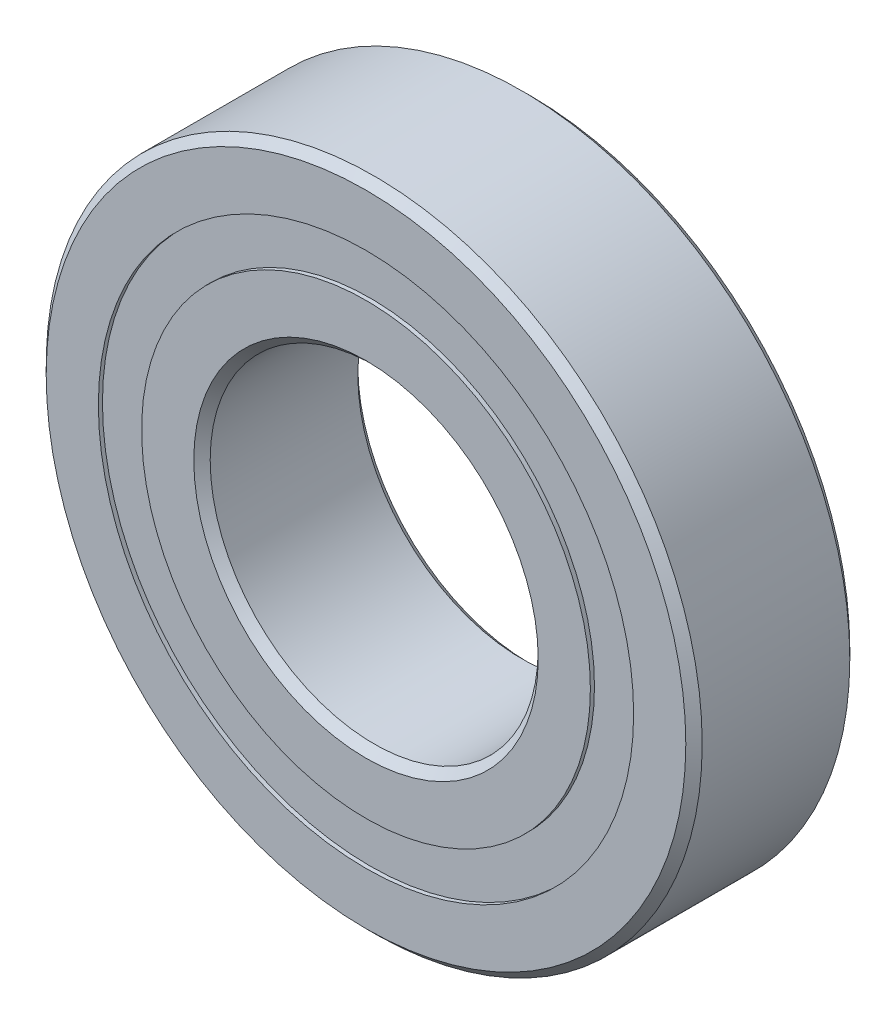
ISO-10303-21;
HEADER;
FILE_DESCRIPTION(('STEP AP214'),'2;1');
FILE_NAME('part.step','',(''),(''),'','','');
FILE_SCHEMA(('AUTOMOTIVE_DESIGN { 1 0 10303 214 1 1 1 1 }'));
ENDSEC;
DATA;
#1=APPLICATION_CONTEXT('core data for automotive mechanical design processes');
#2=APPLICATION_PROTOCOL_DEFINITION('international standard','automotive_design',2000,#1);
#3=PRODUCT_CONTEXT('',#1,'mechanical');
#4=PRODUCT('Part','Part','',(#3));
#5=PRODUCT_RELATED_PRODUCT_CATEGORY('part','',(#4));
#6=PRODUCT_DEFINITION_FORMATION('','',#4);
#7=PRODUCT_DEFINITION_CONTEXT('part definition',#1,'design');
#8=PRODUCT_DEFINITION('design','',#6,#7);
#9=PRODUCT_DEFINITION_SHAPE('','',#8);
#10=(LENGTH_UNIT() NAMED_UNIT(*) SI_UNIT(.MILLI.,.METRE.));
#11=(NAMED_UNIT(*) PLANE_ANGLE_UNIT() SI_UNIT($,.RADIAN.));
#12=(NAMED_UNIT(*) SI_UNIT($,.STERADIAN.) SOLID_ANGLE_UNIT());
#13=UNCERTAINTY_MEASURE_WITH_UNIT(LENGTH_MEASURE(1.E-05),#10,'distance_accuracy_value','');
#14=(GEOMETRIC_REPRESENTATION_CONTEXT(3) GLOBAL_UNCERTAINTY_ASSIGNED_CONTEXT((#13)) GLOBAL_UNIT_ASSIGNED_CONTEXT((#10,
#11,#12)) REPRESENTATION_CONTEXT('',''));
#15=CARTESIAN_POINT('',(0.,0.,0.));
#16=DIRECTION('',(0.,0.,1.));
#17=DIRECTION('',(1.,0.,0.));
#18=AXIS2_PLACEMENT_3D('',#15,#16,#17);
#19=CARTESIAN_POINT('',(0.,20.7247252747253,-6.0325));
#20=DIRECTION('',(0.,0.,1.));
#21=DIRECTION('',(1.,0.,0.));
#22=AXIS2_PLACEMENT_3D('',#19,#20,#21);
#23=PLANE('',#22);
#24=CARTESIAN_POINT('',(0.,0.,-6.0325));
#25=DIRECTION('',(0.,0.,1.));
#26=DIRECTION('',(1.,0.,0.));
#27=AXIS2_PLACEMENT_3D('',#24,#25,#26);
#28=CIRCLE('',#27,20.7247252747253);
#29=CARTESIAN_POINT('',(20.7247252747253,0.,-6.0325));
#30=VERTEX_POINT('',#29);
#31=EDGE_CURVE('E58',#30,#30,#28,.T.);
#32=ORIENTED_EDGE('',*,*,#31,.F.);
#33=EDGE_LOOP('',(#32));
#34=FACE_BOUND('',#33,.T.);
#35=CARTESIAN_POINT('',(0.,0.,-6.0325));
#36=DIRECTION('',(0.,0.,1.));
#37=DIRECTION('',(1.,0.,0.));
#38=AXIS2_PLACEMENT_3D('',#35,#36,#37);
#39=CIRCLE('',#38,17.3752747252747);
#40=CARTESIAN_POINT('',(17.3752747252747,0.,-6.0325));
#41=VERTEX_POINT('',#40);
#42=EDGE_CURVE('E11',#41,#41,#39,.T.);
#43=ORIENTED_EDGE('',*,*,#42,.T.);
#44=EDGE_LOOP('',(#43));
#45=FACE_BOUND('',#44,.T.);
#46=ADVANCED_FACE('F44',(#34,#45),#23,.F.);
#47=CARTESIAN_POINT('',(0.,0.,6.35));
#48=DIRECTION('',(0.,0.,1.));
#49=DIRECTION('',(1.,0.,0.));
#50=AXIS2_PLACEMENT_3D('',#47,#48,#49);
#51=CYLINDRICAL_SURFACE('',#50,17.3752747252747);
#52=ORIENTED_EDGE('',*,*,#42,.F.);
#53=EDGE_LOOP('',(#52));
#54=FACE_BOUND('',#53,.T.);
#55=CARTESIAN_POINT('',(0.,0.,-3.28171342706955));
#56=DIRECTION('',(0.,0.,1.));
#57=DIRECTION('',(1.,0.,0.));
#58=AXIS2_PLACEMENT_3D('',#55,#56,#57);
#59=CIRCLE('',#58,17.3752747252747);
#60=CARTESIAN_POINT('',(17.3752747252747,0.,-3.28171342706955));
#61=VERTEX_POINT('',#60);
#62=EDGE_CURVE('E50',#61,#61,#59,.T.);
#63=ORIENTED_EDGE('',*,*,#62,.T.);
#64=EDGE_LOOP('',(#63));
#65=FACE_BOUND('',#64,.T.);
#66=ADVANCED_FACE('F67',(#54,#65),#51,.F.);
#67=CARTESIAN_POINT('',(0.,20.7247252747253,-3.28171342706955));
#68=DIRECTION('',(0.,0.,-1.));
#69=DIRECTION('',(-1.,0.,0.));
#70=AXIS2_PLACEMENT_3D('',#67,#68,#69);
#71=PLANE('',#70);
#72=ORIENTED_EDGE('',*,*,#62,.F.);
#73=EDGE_LOOP('',(#72));
#74=FACE_BOUND('',#73,.T.);
#75=CARTESIAN_POINT('',(0.,0.,-3.28171342706955));
#76=DIRECTION('',(0.,0.,1.));
#77=DIRECTION('',(1.,0.,0.));
#78=AXIS2_PLACEMENT_3D('',#75,#76,#77);
#79=CIRCLE('',#78,20.7247252747253);
#80=CARTESIAN_POINT('',(20.7247252747253,0.,-3.28171342706955));
#81=VERTEX_POINT('',#80);
#82=EDGE_CURVE('E54',#81,#81,#79,.T.);
#83=ORIENTED_EDGE('',*,*,#82,.T.);
#84=EDGE_LOOP('',(#83));
#85=FACE_BOUND('',#84,.T.);
#86=ADVANCED_FACE('F71',(#74,#85),#71,.F.);
#87=CARTESIAN_POINT('',(0.,0.,6.35));
#88=DIRECTION('',(0.,0.,1.));
#89=DIRECTION('',(1.,0.,0.));
#90=AXIS2_PLACEMENT_3D('',#87,#88,#89);
#91=CYLINDRICAL_SURFACE('',#90,20.7247252747253);
#92=ORIENTED_EDGE('',*,*,#82,.F.);
#93=EDGE_LOOP('',(#92));
#94=FACE_BOUND('',#93,.T.);
#95=ORIENTED_EDGE('',*,*,#31,.T.);
#96=EDGE_LOOP('',(#95));
#97=FACE_BOUND('',#96,.T.);
#98=ADVANCED_FACE('F64',(#94,#97),#91,.T.);
#99=CLOSED_SHELL('',(#46,#66,#86,#98));
#100=MANIFOLD_SOLID_BREP('B2',#99);
#101=CARTESIAN_POINT('',(0.,20.7247252747253,6.03250000000001));
#102=DIRECTION('',(0.,0.,-1.));
#103=DIRECTION('',(-1.,0.,0.));
#104=AXIS2_PLACEMENT_3D('',#101,#102,#103);
#105=PLANE('',#104);
#106=CARTESIAN_POINT('',(0.,0.,6.03250000000001));
#107=DIRECTION('',(0.,0.,1.));
#108=DIRECTION('',(1.,0.,0.));
#109=AXIS2_PLACEMENT_3D('',#106,#107,#108);
#110=CIRCLE('',#109,17.3752747252747);
#111=CARTESIAN_POINT('',(17.3752747252747,0.,6.03250000000001));
#112=VERTEX_POINT('',#111);
#113=EDGE_CURVE('E43',#112,#112,#110,.T.);
#114=ORIENTED_EDGE('',*,*,#113,.F.);
#115=EDGE_LOOP('',(#114));
#116=FACE_BOUND('',#115,.T.);
#117=CARTESIAN_POINT('',(0.,0.,6.03250000000001));
#118=DIRECTION('',(0.,0.,1.));
#119=DIRECTION('',(1.,0.,0.));
#120=AXIS2_PLACEMENT_3D('',#117,#118,#119);
#121=CIRCLE('',#120,20.7247252747253);
#122=CARTESIAN_POINT('',(20.7247252747253,0.,6.03250000000001));
#123=VERTEX_POINT('',#122);
#124=EDGE_CURVE('E126',#123,#123,#121,.T.);
#125=ORIENTED_EDGE('',*,*,#124,.T.);
#126=EDGE_LOOP('',(#125));
#127=FACE_BOUND('',#126,.T.);
#128=ADVANCED_FACE('F112',(#116,#127),#105,.F.);
#129=CARTESIAN_POINT('',(0.,0.,6.35));
#130=DIRECTION('',(0.,0.,1.));
#131=DIRECTION('',(1.,0.,0.));
#132=AXIS2_PLACEMENT_3D('',#129,#130,#131);
#133=CYLINDRICAL_SURFACE('',#132,17.3752747252747);
#134=CARTESIAN_POINT('',(0.,0.,3.28171342706955));
#135=DIRECTION('',(0.,0.,1.));
#136=DIRECTION('',(1.,0.,0.));
#137=AXIS2_PLACEMENT_3D('',#134,#135,#136);
#138=CIRCLE('',#137,17.3752747252747);
#139=CARTESIAN_POINT('',(17.3752747252747,0.,3.28171342706955));
#140=VERTEX_POINT('',#139);
#141=EDGE_CURVE('E118',#140,#140,#138,.T.);
#142=ORIENTED_EDGE('',*,*,#141,.F.);
#143=EDGE_LOOP('',(#142));
#144=FACE_BOUND('',#143,.T.);
#145=ORIENTED_EDGE('',*,*,#113,.T.);
#146=EDGE_LOOP('',(#145));
#147=FACE_BOUND('',#146,.T.);
#148=ADVANCED_FACE('F141',(#144,#147),#133,.F.);
#149=CARTESIAN_POINT('',(0.,20.7247252747253,3.28171342706955));
#150=DIRECTION('',(0.,0.,1.));
#151=DIRECTION('',(1.,0.,0.));
#152=AXIS2_PLACEMENT_3D('',#149,#150,#151);
#153=PLANE('',#152);
#154=CARTESIAN_POINT('',(0.,0.,3.28171342706955));
#155=DIRECTION('',(0.,0.,1.));
#156=DIRECTION('',(1.,0.,0.));
#157=AXIS2_PLACEMENT_3D('',#154,#155,#156);
#158=CIRCLE('',#157,20.7247252747253);
#159=CARTESIAN_POINT('',(20.7247252747253,0.,3.28171342706955));
#160=VERTEX_POINT('',#159);
#161=EDGE_CURVE('E122',#160,#160,#158,.T.);
#162=ORIENTED_EDGE('',*,*,#161,.F.);
#163=EDGE_LOOP('',(#162));
#164=FACE_BOUND('',#163,.T.);
#165=ORIENTED_EDGE('',*,*,#141,.T.);
#166=EDGE_LOOP('',(#165));
#167=FACE_BOUND('',#166,.T.);
#168=ADVANCED_FACE('F136',(#164,#167),#153,.F.);
#169=CARTESIAN_POINT('',(0.,0.,6.35));
#170=DIRECTION('',(0.,0.,1.));
#171=DIRECTION('',(1.,0.,0.));
#172=AXIS2_PLACEMENT_3D('',#169,#170,#171);
#173=CYLINDRICAL_SURFACE('',#172,20.7247252747253);
#174=ORIENTED_EDGE('',*,*,#124,.F.);
#175=EDGE_LOOP('',(#174));
#176=FACE_BOUND('',#175,.T.);
#177=ORIENTED_EDGE('',*,*,#161,.T.);
#178=EDGE_LOOP('',(#177));
#179=FACE_BOUND('',#178,.T.);
#180=ADVANCED_FACE('F133',(#176,#179),#173,.T.);
#181=CLOSED_SHELL('',(#128,#148,#168,#180));
#182=MANIFOLD_SOLID_BREP('B6',#181);
#183=CARTESIAN_POINT('',(-9.52499999999979,16.4977839420937,0.));
#184=DIRECTION('',(0.,0.,1.));
#185=DIRECTION('',(-0.499999999999989,0.866025403784445,0.));
#186=AXIS2_PLACEMENT_3D('',#183,#184,#185);
#187=SPHERICAL_SURFACE('',#186,3.28171342706955);
#188=CARTESIAN_POINT('',(-9.52499999999979,16.4977839420937,3.28171342706955));
#189=VERTEX_POINT('',#188);
#190=VERTEX_LOOP('',#189);
#191=FACE_BOUND('',#190,.T.);
#192=ADVANCED_FACE('F179',(#191),#187,.T.);
#193=CLOSED_SHELL('',(#192));
#194=MANIFOLD_SOLID_BREP('B38',#193);
#195=CARTESIAN_POINT('',(-16.4977839420934,9.52500000000019,0.));
#196=DIRECTION('',(0.,0.,1.));
#197=DIRECTION('',(-0.866025403784433,0.50000000000001,0.));
#198=AXIS2_PLACEMENT_3D('',#195,#196,#197);
#199=SPHERICAL_SURFACE('',#198,3.28171342706955);
#200=CARTESIAN_POINT('',(-16.4977839420934,9.52500000000019,3.28171342706955));
#201=VERTEX_POINT('',#200);
#202=VERTEX_LOOP('',#201);
#203=FACE_BOUND('',#202,.T.);
#204=ADVANCED_FACE('F199',(#203),#199,.T.);
#205=CLOSED_SHELL('',(#204));
#206=MANIFOLD_SOLID_BREP('B108',#205);
#207=CARTESIAN_POINT('',(-19.05,1.99538274087401E-13,0.));
#208=DIRECTION('',(0.,0.,1.));
#209=DIRECTION('',(-1.,0.,0.));
#210=AXIS2_PLACEMENT_3D('',#207,#208,#209);
#211=SPHERICAL_SURFACE('',#210,3.28171342706955);
#212=CARTESIAN_POINT('',(-19.05,1.99538274087401E-13,3.28171342706955));
#213=VERTEX_POINT('',#212);
#214=VERTEX_LOOP('',#213);
#215=FACE_BOUND('',#214,.T.);
#216=ADVANCED_FACE('F219',(#215),#211,.T.);
#217=CLOSED_SHELL('',(#216));
#218=MANIFOLD_SOLID_BREP('B175',#217);
#219=CARTESIAN_POINT('',(-16.4977839420936,-9.52499999999985,0.));
#220=DIRECTION('',(0.,0.,1.));
#221=DIRECTION('',(-0.866025403784443,-0.499999999999992,0.));
#222=AXIS2_PLACEMENT_3D('',#219,#220,#221);
#223=SPHERICAL_SURFACE('',#222,3.28171342706955);
#224=CARTESIAN_POINT('',(-16.4977839420936,-9.52499999999985,3.28171342706955));
#225=VERTEX_POINT('',#224);
#226=VERTEX_LOOP('',#225);
#227=FACE_BOUND('',#226,.T.);
#228=ADVANCED_FACE('F239',(#227),#223,.T.);
#229=CLOSED_SHELL('',(#228));
#230=MANIFOLD_SOLID_BREP('B195',#229);
#231=CARTESIAN_POINT('',(-9.52500000000014,-16.4977839420935,0.));
#232=DIRECTION('',(0.,0.,1.));
#233=DIRECTION('',(-0.500000000000007,-0.866025403784435,0.));
#234=AXIS2_PLACEMENT_3D('',#231,#232,#233);
#235=SPHERICAL_SURFACE('',#234,3.28171342706955);
#236=CARTESIAN_POINT('',(-9.52500000000014,-16.4977839420935,3.28171342706955));
#237=VERTEX_POINT('',#236);
#238=VERTEX_LOOP('',#237);
#239=FACE_BOUND('',#238,.T.);
#240=ADVANCED_FACE('F259',(#239),#235,.T.);
#241=CLOSED_SHELL('',(#240));
#242=MANIFOLD_SOLID_BREP('B215',#241);
#243=CARTESIAN_POINT('',(-1.33025516058267E-13,-19.05,0.));
#244=DIRECTION('',(0.,0.,1.));
#245=DIRECTION('',(0.,-1.,0.));
#246=AXIS2_PLACEMENT_3D('',#243,#244,#245);
#247=SPHERICAL_SURFACE('',#246,3.28171342706955);
#248=CARTESIAN_POINT('',(-1.33025516058267E-13,-19.05,3.28171342706955));
#249=VERTEX_POINT('',#248);
#250=VERTEX_LOOP('',#249);
#251=FACE_BOUND('',#250,.T.);
#252=ADVANCED_FACE('F279',(#251),#247,.T.);
#253=CLOSED_SHELL('',(#252));
#254=MANIFOLD_SOLID_BREP('B235',#253);
#255=CARTESIAN_POINT('',(9.5249999999999,-16.4977839420936,0.));
#256=DIRECTION('',(0.,0.,1.));
#257=DIRECTION('',(0.499999999999995,-0.866025403784442,0.));
#258=AXIS2_PLACEMENT_3D('',#255,#256,#257);
#259=SPHERICAL_SURFACE('',#258,3.28171342706955);
#260=CARTESIAN_POINT('',(9.5249999999999,-16.4977839420936,3.28171342706955));
#261=VERTEX_POINT('',#260);
#262=VERTEX_LOOP('',#261);
#263=FACE_BOUND('',#262,.T.);
#264=ADVANCED_FACE('F299',(#263),#259,.T.);
#265=CLOSED_SHELL('',(#264));
#266=MANIFOLD_SOLID_BREP('B255',#265);
#267=CARTESIAN_POINT('',(16.4977839420935,-9.52500000000008,0.));
#268=DIRECTION('',(0.,0.,1.));
#269=DIRECTION('',(0.866025403784436,-0.500000000000004,0.));
#270=AXIS2_PLACEMENT_3D('',#267,#268,#269);
#271=SPHERICAL_SURFACE('',#270,3.28171342706955);
#272=CARTESIAN_POINT('',(16.4977839420935,-9.52500000000008,3.28171342706955));
#273=VERTEX_POINT('',#272);
#274=VERTEX_LOOP('',#273);
#275=FACE_BOUND('',#274,.T.);
#276=ADVANCED_FACE('F319',(#275),#271,.T.);
#277=CLOSED_SHELL('',(#276));
#278=MANIFOLD_SOLID_BREP('B275',#277);
#279=CARTESIAN_POINT('',(19.05,0.,0.));
#280=DIRECTION('',(0.,0.,1.));
#281=DIRECTION('',(1.,0.,0.));
#282=AXIS2_PLACEMENT_3D('',#279,#280,#281);
#283=SPHERICAL_SURFACE('',#282,3.28171342706955);
#284=CARTESIAN_POINT('',(19.05,0.,3.28171342706955));
#285=VERTEX_POINT('',#284);
#286=VERTEX_LOOP('',#285);
#287=FACE_BOUND('',#286,.T.);
#288=ADVANCED_FACE('F339',(#287),#283,.T.);
#289=CLOSED_SHELL('',(#288));
#290=MANIFOLD_SOLID_BREP('B295',#289);
#291=CARTESIAN_POINT('',(16.4977839420936,9.52499999999996,0.));
#292=DIRECTION('',(0.,0.,1.));
#293=DIRECTION('',(0.86602540378444,0.499999999999998,0.));
#294=AXIS2_PLACEMENT_3D('',#291,#292,#293);
#295=SPHERICAL_SURFACE('',#294,3.28171342706955);
#296=CARTESIAN_POINT('',(16.4977839420936,9.52499999999996,3.28171342706955));
#297=VERTEX_POINT('',#296);
#298=VERTEX_LOOP('',#297);
#299=FACE_BOUND('',#298,.T.);
#300=ADVANCED_FACE('F359',(#299),#295,.T.);
#301=CLOSED_SHELL('',(#300));
#302=MANIFOLD_SOLID_BREP('B315',#301);
#303=CARTESIAN_POINT('',(9.52500000000002,16.4977839420935,0.));
#304=DIRECTION('',(0.,0.,1.));
#305=DIRECTION('',(0.500000000000001,0.866025403784438,0.));
#306=AXIS2_PLACEMENT_3D('',#303,#304,#305);
#307=SPHERICAL_SURFACE('',#306,3.28171342706955);
#308=CARTESIAN_POINT('',(9.52500000000002,16.4977839420935,3.28171342706955));
#309=VERTEX_POINT('',#308);
#310=VERTEX_LOOP('',#309);
#311=FACE_BOUND('',#310,.T.);
#312=ADVANCED_FACE('F379',(#311),#307,.T.);
#313=CLOSED_SHELL('',(#312));
#314=MANIFOLD_SOLID_BREP('B335',#313);
#315=CARTESIAN_POINT('',(0.,19.05,0.));
#316=DIRECTION('',(0.,0.,1.));
#317=DIRECTION('',(0.,1.,0.));
#318=AXIS2_PLACEMENT_3D('',#315,#316,#317);
#319=SPHERICAL_SURFACE('',#318,3.28171342706955);
#320=CARTESIAN_POINT('',(0.,19.05,3.28171342706955));
#321=VERTEX_POINT('',#320);
#322=VERTEX_LOOP('',#321);
#323=FACE_BOUND('',#322,.T.);
#324=ADVANCED_FACE('F402',(#323),#319,.T.);
#325=CLOSED_SHELL('',(#324));
#326=MANIFOLD_SOLID_BREP('B355',#325);
#327=CARTESIAN_POINT('',(0.,17.3752747252747,6.35));
#328=DIRECTION('',(0.,0.,-1.));
#329=DIRECTION('',(-1.,0.,0.));
#330=AXIS2_PLACEMENT_3D('',#327,#328,#329);
#331=PLANE('',#330);
#332=CARTESIAN_POINT('',(0.,0.,6.35));
#333=DIRECTION('',(0.,0.,1.));
#334=DIRECTION('',(1.,0.,0.));
#335=AXIS2_PLACEMENT_3D('',#332,#333,#334);
#336=CIRCLE('',#335,13.335);
#337=CARTESIAN_POINT('',(13.335,0.,6.35));
#338=VERTEX_POINT('',#337);
#339=EDGE_CURVE('E450',#338,#338,#336,.T.);
#340=ORIENTED_EDGE('',*,*,#339,.F.);
#341=EDGE_LOOP('',(#340));
#342=FACE_BOUND('',#341,.T.);
#343=CARTESIAN_POINT('',(0.,0.,6.35));
#344=DIRECTION('',(0.,0.,1.));
#345=DIRECTION('',(1.,0.,0.));
#346=AXIS2_PLACEMENT_3D('',#343,#344,#345);
#347=CIRCLE('',#346,17.3752747252747);
#348=CARTESIAN_POINT('',(17.3752747252747,0.,6.35));
#349=VERTEX_POINT('',#348);
#350=EDGE_CURVE('E401',#349,#349,#347,.T.);
#351=ORIENTED_EDGE('',*,*,#350,.T.);
#352=EDGE_LOOP('',(#351));
#353=FACE_BOUND('',#352,.T.);
#354=ADVANCED_FACE('F422',(#342,#353),#331,.F.);
#355=CARTESIAN_POINT('',(0.,0.,6.35));
#356=DIRECTION('',(0.,0.,1.));
#357=DIRECTION('',(1.,0.,0.));
#358=AXIS2_PLACEMENT_3D('',#355,#356,#357);
#359=CYLINDRICAL_SURFACE('',#358,17.3752747252747);
#360=ORIENTED_EDGE('',*,*,#350,.F.);
#361=EDGE_LOOP('',(#360));
#362=FACE_BOUND('',#361,.T.);
#363=CARTESIAN_POINT('',(0.,0.,2.82222222222222));
#364=DIRECTION('',(0.,0.,1.));
#365=DIRECTION('',(1.,0.,0.));
#366=AXIS2_PLACEMENT_3D('',#363,#364,#365);
#367=CIRCLE('',#366,17.3752747252747);
#368=CARTESIAN_POINT('',(17.3752747252747,0.,2.82222222222222));
#369=VERTEX_POINT('',#368);
#370=EDGE_CURVE('E428',#369,#369,#367,.T.);
#371=ORIENTED_EDGE('',*,*,#370,.T.);
#372=EDGE_LOOP('',(#371));
#373=FACE_BOUND('',#372,.T.);
#374=ADVANCED_FACE('F457',(#362,#373),#359,.T.);
#375=CARTESIAN_POINT('',(0.,0.,0.));
#376=DIRECTION('',(0.,0.,1.));
#377=DIRECTION('',(1.,0.,0.));
#378=AXIS2_PLACEMENT_3D('',#375,#376,#377);
#379=TOROIDAL_SURFACE('',#378,19.05,3.28171342706955);
#380=ORIENTED_EDGE('',*,*,#370,.F.);
#381=EDGE_LOOP('',(#380));
#382=FACE_BOUND('',#381,.T.);
#383=CARTESIAN_POINT('',(0.,0.,-2.82222222222223));
#384=DIRECTION('',(0.,0.,1.));
#385=DIRECTION('',(1.,0.,0.));
#386=AXIS2_PLACEMENT_3D('',#383,#384,#385);
#387=CIRCLE('',#386,17.3752747252747);
#388=CARTESIAN_POINT('',(17.3752747252747,0.,-2.82222222222223));
#389=VERTEX_POINT('',#388);
#390=EDGE_CURVE('E432',#389,#389,#387,.T.);
#391=ORIENTED_EDGE('',*,*,#390,.T.);
#392=EDGE_LOOP('',(#391));
#393=FACE_BOUND('',#392,.T.);
#394=ADVANCED_FACE('F461',(#382,#393),#379,.F.);
#395=CARTESIAN_POINT('',(0.,0.,6.35));
#396=DIRECTION('',(0.,0.,1.));
#397=DIRECTION('',(1.,0.,0.));
#398=AXIS2_PLACEMENT_3D('',#395,#396,#397);
#399=CYLINDRICAL_SURFACE('',#398,17.3752747252747);
#400=ORIENTED_EDGE('',*,*,#390,.F.);
#401=EDGE_LOOP('',(#400));
#402=FACE_BOUND('',#401,.T.);
#403=CARTESIAN_POINT('',(0.,0.,-6.35));
#404=DIRECTION('',(0.,0.,1.));
#405=DIRECTION('',(1.,0.,0.));
#406=AXIS2_PLACEMENT_3D('',#403,#404,#405);
#407=CIRCLE('',#406,17.3752747252747);
#408=CARTESIAN_POINT('',(17.3752747252747,0.,-6.35));
#409=VERTEX_POINT('',#408);
#410=EDGE_CURVE('E436',#409,#409,#407,.T.);
#411=ORIENTED_EDGE('',*,*,#410,.T.);
#412=EDGE_LOOP('',(#411));
#413=FACE_BOUND('',#412,.T.);
#414=ADVANCED_FACE('F466',(#402,#413),#399,.T.);
#415=CARTESIAN_POINT('',(0.,13.335,-6.35));
#416=DIRECTION('',(0.,0.,1.));
#417=DIRECTION('',(1.,0.,0.));
#418=AXIS2_PLACEMENT_3D('',#415,#416,#417);
#419=PLANE('',#418);
#420=ORIENTED_EDGE('',*,*,#410,.F.);
#421=EDGE_LOOP('',(#420));
#422=FACE_BOUND('',#421,.T.);
#423=CARTESIAN_POINT('',(0.,0.,-6.35));
#424=DIRECTION('',(0.,0.,1.));
#425=DIRECTION('',(1.,0.,0.));
#426=AXIS2_PLACEMENT_3D('',#423,#424,#425);
#427=CIRCLE('',#426,13.335);
#428=CARTESIAN_POINT('',(13.335,0.,-6.35));
#429=VERTEX_POINT('',#428);
#430=EDGE_CURVE('E441',#429,#429,#427,.T.);
#431=ORIENTED_EDGE('',*,*,#430,.T.);
#432=EDGE_LOOP('',(#431));
#433=FACE_BOUND('',#432,.T.);
#434=ADVANCED_FACE('F472',(#422,#433),#419,.F.);
#435=CARTESIAN_POINT('',(0.,0.,-5.715));
#436=DIRECTION('',(0.,0.,-1.));
#437=DIRECTION('',(-1.,0.,0.));
#438=AXIS2_PLACEMENT_3D('',#435,#436,#437);
#439=CONICAL_SURFACE('',#438,12.7,0.785398163397446);
#440=ORIENTED_EDGE('',*,*,#430,.F.);
#441=EDGE_LOOP('',(#440));
#442=FACE_BOUND('',#441,.T.);
#443=CARTESIAN_POINT('',(0.,0.,-5.715));
#444=DIRECTION('',(0.,0.,1.));
#445=DIRECTION('',(1.,0.,0.));
#446=AXIS2_PLACEMENT_3D('',#443,#444,#445);
#447=CIRCLE('',#446,12.7);
#448=CARTESIAN_POINT('',(12.7,0.,-5.715));
#449=VERTEX_POINT('',#448);
#450=EDGE_CURVE('E444',#449,#449,#447,.T.);
#451=ORIENTED_EDGE('',*,*,#450,.T.);
#452=EDGE_LOOP('',(#451));
#453=FACE_BOUND('',#452,.T.);
#454=ADVANCED_FACE('F476',(#442,#453),#439,.F.);
#455=CARTESIAN_POINT('',(0.,0.,6.35));
#456=DIRECTION('',(0.,0.,1.));
#457=DIRECTION('',(1.,0.,0.));
#458=AXIS2_PLACEMENT_3D('',#455,#456,#457);
#459=CYLINDRICAL_SURFACE('',#458,12.7);
#460=ORIENTED_EDGE('',*,*,#450,.F.);
#461=EDGE_LOOP('',(#460));
#462=FACE_BOUND('',#461,.T.);
#463=CARTESIAN_POINT('',(0.,0.,5.715));
#464=DIRECTION('',(0.,0.,1.));
#465=DIRECTION('',(1.,0.,0.));
#466=AXIS2_PLACEMENT_3D('',#463,#464,#465);
#467=CIRCLE('',#466,12.7);
#468=CARTESIAN_POINT('',(12.7,0.,5.715));
#469=VERTEX_POINT('',#468);
#470=EDGE_CURVE('E447',#469,#469,#467,.T.);
#471=ORIENTED_EDGE('',*,*,#470,.T.);
#472=EDGE_LOOP('',(#471));
#473=FACE_BOUND('',#472,.T.);
#474=ADVANCED_FACE('F480',(#462,#473),#459,.F.);
#475=CARTESIAN_POINT('',(0.,0.,6.35));
#476=DIRECTION('',(0.,0.,1.));
#477=DIRECTION('',(1.,0.,0.));
#478=AXIS2_PLACEMENT_3D('',#475,#476,#477);
#479=CONICAL_SURFACE('',#478,13.335,0.785398163397451);
#480=ORIENTED_EDGE('',*,*,#470,.F.);
#481=EDGE_LOOP('',(#480));
#482=FACE_BOUND('',#481,.T.);
#483=ORIENTED_EDGE('',*,*,#339,.T.);
#484=EDGE_LOOP('',(#483));
#485=FACE_BOUND('',#484,.T.);
#486=ADVANCED_FACE('F454',(#482,#485),#479,.F.);
#487=CLOSED_SHELL('',(#354,#374,#394,#414,#434,#454,#474,#486));
#488=MANIFOLD_SOLID_BREP('B375',#487);
#489=CARTESIAN_POINT('',(0.,0.,5.715));
#490=DIRECTION('',(0.,0.,-1.));
#491=DIRECTION('',(-1.,0.,0.));
#492=AXIS2_PLACEMENT_3D('',#489,#490,#491);
#493=CONICAL_SURFACE('',#492,25.4,0.785398163397446);
#494=CARTESIAN_POINT('',(0.,0.,6.35));
#495=DIRECTION('',(0.,0.,1.));
#496=DIRECTION('',(1.,0.,0.));
#497=AXIS2_PLACEMENT_3D('',#494,#495,#496);
#498=CIRCLE('',#497,24.765);
#499=CARTESIAN_POINT('',(24.765,0.,6.35));
#500=VERTEX_POINT('',#499);
#501=EDGE_CURVE('E572',#500,#500,#498,.T.);
#502=ORIENTED_EDGE('',*,*,#501,.F.);
#503=EDGE_LOOP('',(#502));
#504=FACE_BOUND('',#503,.T.);
#505=CARTESIAN_POINT('',(0.,0.,5.715));
#506=DIRECTION('',(0.,0.,1.));
#507=DIRECTION('',(1.,0.,0.));
#508=AXIS2_PLACEMENT_3D('',#505,#506,#507);
#509=CIRCLE('',#508,25.4);
#510=CARTESIAN_POINT('',(25.4,0.,5.715));
#511=VERTEX_POINT('',#510);
#512=EDGE_CURVE('E421',#511,#511,#509,.T.);
#513=ORIENTED_EDGE('',*,*,#512,.T.);
#514=EDGE_LOOP('',(#513));
#515=FACE_BOUND('',#514,.T.);
#516=ADVANCED_FACE('F544',(#504,#515),#493,.T.);
#517=CARTESIAN_POINT('',(0.,0.,6.35));
#518=DIRECTION('',(0.,0.,1.));
#519=DIRECTION('',(1.,0.,0.));
#520=AXIS2_PLACEMENT_3D('',#517,#518,#519);
#521=CYLINDRICAL_SURFACE('',#520,25.4);
#522=ORIENTED_EDGE('',*,*,#512,.F.);
#523=EDGE_LOOP('',(#522));
#524=FACE_BOUND('',#523,.T.);
#525=CARTESIAN_POINT('',(0.,0.,-5.715));
#526=DIRECTION('',(0.,0.,1.));
#527=DIRECTION('',(1.,0.,0.));
#528=AXIS2_PLACEMENT_3D('',#525,#526,#527);
#529=CIRCLE('',#528,25.4);
#530=CARTESIAN_POINT('',(25.4,0.,-5.715));
#531=VERTEX_POINT('',#530);
#532=EDGE_CURVE('E550',#531,#531,#529,.T.);
#533=ORIENTED_EDGE('',*,*,#532,.T.);
#534=EDGE_LOOP('',(#533));
#535=FACE_BOUND('',#534,.T.);
#536=ADVANCED_FACE('F579',(#524,#535),#521,.T.);
#537=CARTESIAN_POINT('',(0.,0.,-6.35));
#538=DIRECTION('',(0.,0.,1.));
#539=DIRECTION('',(1.,0.,0.));
#540=AXIS2_PLACEMENT_3D('',#537,#538,#539);
#541=CONICAL_SURFACE('',#540,24.765,0.785398163397446);
#542=ORIENTED_EDGE('',*,*,#532,.F.);
#543=EDGE_LOOP('',(#542));
#544=FACE_BOUND('',#543,.T.);
#545=CARTESIAN_POINT('',(0.,0.,-6.35));
#546=DIRECTION('',(0.,0.,1.));
#547=DIRECTION('',(1.,0.,0.));
#548=AXIS2_PLACEMENT_3D('',#545,#546,#547);
#549=CIRCLE('',#548,24.765);
#550=CARTESIAN_POINT('',(24.765,0.,-6.35));
#551=VERTEX_POINT('',#550);
#552=EDGE_CURVE('E554',#551,#551,#549,.T.);
#553=ORIENTED_EDGE('',*,*,#552,.T.);
#554=EDGE_LOOP('',(#553));
#555=FACE_BOUND('',#554,.T.);
#556=ADVANCED_FACE('F583',(#544,#555),#541,.T.);
#557=CARTESIAN_POINT('',(0.,24.765,-6.35));
#558=DIRECTION('',(0.,0.,1.));
#559=DIRECTION('',(1.,0.,0.));
#560=AXIS2_PLACEMENT_3D('',#557,#558,#559);
#561=PLANE('',#560);
#562=ORIENTED_EDGE('',*,*,#552,.F.);
#563=EDGE_LOOP('',(#562));
#564=FACE_BOUND('',#563,.T.);
#565=CARTESIAN_POINT('',(0.,0.,-6.35));
#566=DIRECTION('',(0.,0.,1.));
#567=DIRECTION('',(1.,0.,0.));
#568=AXIS2_PLACEMENT_3D('',#565,#566,#567);
#569=CIRCLE('',#568,20.7247252747253);
#570=CARTESIAN_POINT('',(20.7247252747253,0.,-6.35));
#571=VERTEX_POINT('',#570);
#572=EDGE_CURVE('E558',#571,#571,#569,.T.);
#573=ORIENTED_EDGE('',*,*,#572,.T.);
#574=EDGE_LOOP('',(#573));
#575=FACE_BOUND('',#574,.T.);
#576=ADVANCED_FACE('F588',(#564,#575),#561,.F.);
#577=CARTESIAN_POINT('',(0.,0.,6.35));
#578=DIRECTION('',(0.,0.,1.));
#579=DIRECTION('',(1.,0.,0.));
#580=AXIS2_PLACEMENT_3D('',#577,#578,#579);
#581=CYLINDRICAL_SURFACE('',#580,20.7247252747253);
#582=ORIENTED_EDGE('',*,*,#572,.F.);
#583=EDGE_LOOP('',(#582));
#584=FACE_BOUND('',#583,.T.);
#585=CARTESIAN_POINT('',(0.,0.,-2.82222222222222));
#586=DIRECTION('',(0.,0.,1.));
#587=DIRECTION('',(1.,0.,0.));
#588=AXIS2_PLACEMENT_3D('',#585,#586,#587);
#589=CIRCLE('',#588,20.7247252747253);
#590=CARTESIAN_POINT('',(20.7247252747253,0.,-2.82222222222222));
#591=VERTEX_POINT('',#590);
#592=EDGE_CURVE('E563',#591,#591,#589,.T.);
#593=ORIENTED_EDGE('',*,*,#592,.T.);
#594=EDGE_LOOP('',(#593));
#595=FACE_BOUND('',#594,.T.);
#596=ADVANCED_FACE('F594',(#584,#595),#581,.F.);
#597=CARTESIAN_POINT('',(0.,0.,0.));
#598=DIRECTION('',(0.,0.,1.));
#599=DIRECTION('',(1.,0.,0.));
#600=AXIS2_PLACEMENT_3D('',#597,#598,#599);
#601=TOROIDAL_SURFACE('',#600,19.05,3.28171342706955);
#602=ORIENTED_EDGE('',*,*,#592,.F.);
#603=EDGE_LOOP('',(#602));
#604=FACE_BOUND('',#603,.T.);
#605=CARTESIAN_POINT('',(0.,0.,2.82222222222222));
#606=DIRECTION('',(0.,0.,1.));
#607=DIRECTION('',(1.,0.,0.));
#608=AXIS2_PLACEMENT_3D('',#605,#606,#607);
#609=CIRCLE('',#608,20.7247252747253);
#610=CARTESIAN_POINT('',(20.7247252747253,0.,2.82222222222222));
#611=VERTEX_POINT('',#610);
#612=EDGE_CURVE('E566',#611,#611,#609,.T.);
#613=ORIENTED_EDGE('',*,*,#612,.T.);
#614=EDGE_LOOP('',(#613));
#615=FACE_BOUND('',#614,.T.);
#616=ADVANCED_FACE('F598',(#604,#615),#601,.F.);
#617=CARTESIAN_POINT('',(0.,0.,6.35));
#618=DIRECTION('',(0.,0.,1.));
#619=DIRECTION('',(1.,0.,0.));
#620=AXIS2_PLACEMENT_3D('',#617,#618,#619);
#621=CYLINDRICAL_SURFACE('',#620,20.7247252747253);
#622=ORIENTED_EDGE('',*,*,#612,.F.);
#623=EDGE_LOOP('',(#622));
#624=FACE_BOUND('',#623,.T.);
#625=CARTESIAN_POINT('',(0.,0.,6.35));
#626=DIRECTION('',(0.,0.,1.));
#627=DIRECTION('',(1.,0.,0.));
#628=AXIS2_PLACEMENT_3D('',#625,#626,#627);
#629=CIRCLE('',#628,20.7247252747253);
#630=CARTESIAN_POINT('',(20.7247252747253,0.,6.35));
#631=VERTEX_POINT('',#630);
#632=EDGE_CURVE('E569',#631,#631,#629,.T.);
#633=ORIENTED_EDGE('',*,*,#632,.T.);
#634=EDGE_LOOP('',(#633));
#635=FACE_BOUND('',#634,.T.);
#636=ADVANCED_FACE('F602',(#624,#635),#621,.F.);
#637=CARTESIAN_POINT('',(0.,24.765,6.35));
#638=DIRECTION('',(0.,0.,-1.));
#639=DIRECTION('',(-1.,0.,0.));
#640=AXIS2_PLACEMENT_3D('',#637,#638,#639);
#641=PLANE('',#640);
#642=ORIENTED_EDGE('',*,*,#632,.F.);
#643=EDGE_LOOP('',(#642));
#644=FACE_BOUND('',#643,.T.);
#645=ORIENTED_EDGE('',*,*,#501,.T.);
#646=EDGE_LOOP('',(#645));
#647=FACE_BOUND('',#646,.T.);
#648=ADVANCED_FACE('F576',(#644,#647),#641,.F.);
#649=CLOSED_SHELL('',(#516,#536,#556,#576,#596,#616,#636,#648));
#650=MANIFOLD_SOLID_BREP('B396',#649);
#651=ADVANCED_BREP_SHAPE_REPRESENTATION('',(#18,#100,#182,#194,#206,#218,#230,#242,#254,#266,
#278,#290,#302,#314,#326,#488,#650),#14);
#652=SHAPE_DEFINITION_REPRESENTATION(#9,#651);
ENDSEC;
END-ISO-10303-21;
